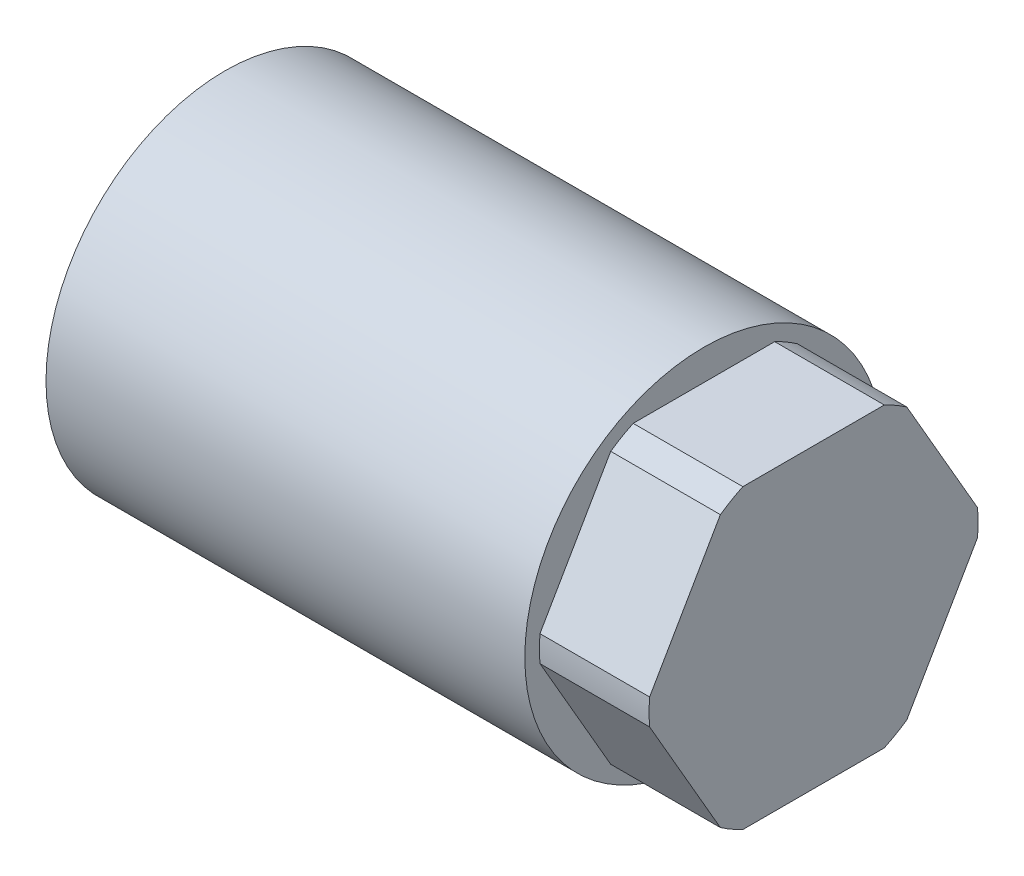
ISO-10303-21;
HEADER;
FILE_DESCRIPTION(('STEP AP214'),'2;1');
FILE_NAME('part.step','',(''),(''),'','','');
FILE_SCHEMA(('AUTOMOTIVE_DESIGN { 1 0 10303 214 1 1 1 1 }'));
ENDSEC;
DATA;
#1=APPLICATION_CONTEXT('core data for automotive mechanical design processes');
#2=APPLICATION_PROTOCOL_DEFINITION('international standard','automotive_design',2000,#1);
#3=PRODUCT_CONTEXT('',#1,'mechanical');
#4=PRODUCT('Part','Part','',(#3));
#5=PRODUCT_RELATED_PRODUCT_CATEGORY('part','',(#4));
#6=PRODUCT_DEFINITION_FORMATION('','',#4);
#7=PRODUCT_DEFINITION_CONTEXT('part definition',#1,'design');
#8=PRODUCT_DEFINITION('design','',#6,#7);
#9=PRODUCT_DEFINITION_SHAPE('','',#8);
#10=(LENGTH_UNIT() NAMED_UNIT(*) SI_UNIT(.MILLI.,.METRE.));
#11=(NAMED_UNIT(*) PLANE_ANGLE_UNIT() SI_UNIT($,.RADIAN.));
#12=(NAMED_UNIT(*) SI_UNIT($,.STERADIAN.) SOLID_ANGLE_UNIT());
#13=UNCERTAINTY_MEASURE_WITH_UNIT(LENGTH_MEASURE(1.E-05),#10,'distance_accuracy_value','');
#14=(GEOMETRIC_REPRESENTATION_CONTEXT(3) GLOBAL_UNCERTAINTY_ASSIGNED_CONTEXT((#13)) GLOBAL_UNIT_ASSIGNED_CONTEXT((#10,
#11,#12)) REPRESENTATION_CONTEXT('',''));
#15=CARTESIAN_POINT('',(0.,0.,0.));
#16=DIRECTION('',(0.,0.,1.));
#17=DIRECTION('',(1.,0.,0.));
#18=AXIS2_PLACEMENT_3D('',#15,#16,#17);
#19=CARTESIAN_POINT('',(0.,6.35,0.));
#20=DIRECTION('',(-1.,0.,0.));
#21=DIRECTION('',(0.,-1.,0.));
#22=AXIS2_PLACEMENT_3D('',#19,#20,#21);
#23=PLANE('',#22);
#24=DIRECTION('',(0.,0.866025403784438,0.5));
#25=VECTOR('',#24,1.);
#26=CARTESIAN_POINT('',(0.,0.,-11.9150661804009));
#27=LINE('',#26,#25);
#28=CARTESIAN_POINT('',(0.,0.901884679620536,-11.394362817844));
#29=VERTEX_POINT('',#28);
#30=CARTESIAN_POINT('',(0.,9.41686532037948,-6.47823645275736));
#31=VERTEX_POINT('',#30);
#32=EDGE_CURVE('E195',#29,#31,#27,.T.);
#33=ORIENTED_EDGE('',*,*,#32,.T.);
#34=CARTESIAN_POINT('',(0.,0.,0.));
#35=DIRECTION('',(-1.,0.,0.));
#36=DIRECTION('',(0.,-1.,0.));
#37=AXIS2_PLACEMENT_3D('',#34,#35,#36);
#38=CIRCLE('',#37,11.43);
#39=CARTESIAN_POINT('',(0.,10.31875,-4.91612636508663));
#40=VERTEX_POINT('',#39);
#41=EDGE_CURVE('E234',#40,#31,#38,.T.);
#42=ORIENTED_EDGE('',*,*,#41,.F.);
#43=DIRECTION('',(0.,0.,1.));
#44=VECTOR('',#43,1.);
#45=CARTESIAN_POINT('',(0.,10.31875,-5.95753309020045));
#46=LINE('',#45,#44);
#47=CARTESIAN_POINT('',(0.,10.31875,4.91612636508663));
#48=VERTEX_POINT('',#47);
#49=EDGE_CURVE('E135',#40,#48,#46,.T.);
#50=ORIENTED_EDGE('',*,*,#49,.T.);
#51=CARTESIAN_POINT('',(0.,9.41686532037948,6.47823645275736));
#52=VERTEX_POINT('',#51);
#53=EDGE_CURVE('E232',#52,#48,#38,.T.);
#54=ORIENTED_EDGE('',*,*,#53,.F.);
#55=DIRECTION('',(0.,-0.866025403784439,0.5));
#56=VECTOR('',#55,1.);
#57=CARTESIAN_POINT('',(0.,10.31875,5.95753309020045));
#58=LINE('',#57,#56);
#59=CARTESIAN_POINT('',(0.,0.901884679620534,11.394362817844));
#60=VERTEX_POINT('',#59);
#61=EDGE_CURVE('E201',#52,#60,#58,.T.);
#62=ORIENTED_EDGE('',*,*,#61,.T.);
#63=CARTESIAN_POINT('',(0.,-0.901884679620526,11.394362817844));
#64=VERTEX_POINT('',#63);
#65=EDGE_CURVE('E48',#64,#60,#38,.T.);
#66=ORIENTED_EDGE('',*,*,#65,.F.);
#67=DIRECTION('',(0.,-0.866025403784438,-0.5));
#68=VECTOR('',#67,1.);
#69=CARTESIAN_POINT('',(0.,0.,11.9150661804009));
#70=LINE('',#69,#68);
#71=CARTESIAN_POINT('',(0.,-9.41686532037948,6.47823645275736));
#72=VERTEX_POINT('',#71);
#73=EDGE_CURVE('E204',#64,#72,#70,.T.);
#74=ORIENTED_EDGE('',*,*,#73,.T.);
#75=CARTESIAN_POINT('',(0.,-10.31875,4.91612636508663));
#76=VERTEX_POINT('',#75);
#77=EDGE_CURVE('E12',#76,#72,#38,.T.);
#78=ORIENTED_EDGE('',*,*,#77,.F.);
#79=DIRECTION('',(0.,0.,-1.));
#80=VECTOR('',#79,1.);
#81=CARTESIAN_POINT('',(0.,-10.31875,5.95753309020045));
#82=LINE('',#81,#80);
#83=CARTESIAN_POINT('',(0.,-10.31875,-4.91612636508663));
#84=VERTEX_POINT('',#83);
#85=EDGE_CURVE('E207',#76,#84,#82,.T.);
#86=ORIENTED_EDGE('',*,*,#85,.T.);
#87=CARTESIAN_POINT('',(0.,-9.41686532037947,-6.47823645275737));
#88=VERTEX_POINT('',#87);
#89=EDGE_CURVE('E49',#88,#84,#38,.T.);
#90=ORIENTED_EDGE('',*,*,#89,.F.);
#91=DIRECTION('',(0.,0.866025403784439,-0.5));
#92=VECTOR('',#91,1.);
#93=CARTESIAN_POINT('',(0.,-10.31875,-5.95753309020046));
#94=LINE('',#93,#92);
#95=CARTESIAN_POINT('',(0.,-0.901884679620541,-11.394362817844));
#96=VERTEX_POINT('',#95);
#97=EDGE_CURVE('E198',#88,#96,#94,.T.);
#98=ORIENTED_EDGE('',*,*,#97,.T.);
#99=EDGE_CURVE('E144',#29,#96,#38,.T.);
#100=ORIENTED_EDGE('',*,*,#99,.F.);
#101=EDGE_LOOP('',(#33,#42,#50,#54,#62,#66,#74,#78,#86,#90,#98,#100));
#102=FACE_BOUND('',#101,.T.);
#103=ADVANCED_FACE('F41',(#102),#23,.F.);
#104=CARTESIAN_POINT('',(-40.894,0.,0.));
#105=DIRECTION('',(-1.,0.,0.));
#106=DIRECTION('',(0.,-1.,0.));
#107=AXIS2_PLACEMENT_3D('',#104,#105,#106);
#108=CYLINDRICAL_SURFACE('',#107,11.43);
#109=DIRECTION('',(-1.,0.,0.));
#110=VECTOR('',#109,1.);
#111=CARTESIAN_POINT('',(-40.894,0.901884679620536,-11.394362817844));
#112=LINE('',#111,#110);
#113=CARTESIAN_POINT('',(-7.62,0.901884679620538,-11.394362817844));
#114=VERTEX_POINT('',#113);
#115=EDGE_CURVE('E162',#29,#114,#112,.T.);
#116=ORIENTED_EDGE('',*,*,#115,.F.);
#117=ORIENTED_EDGE('',*,*,#99,.T.);
#118=DIRECTION('',(-1.,0.,0.));
#119=VECTOR('',#118,1.);
#120=CARTESIAN_POINT('',(-40.894,-0.901884679620542,-11.394362817844));
#121=LINE('',#120,#119);
#122=CARTESIAN_POINT('',(-7.62,-0.901884679620541,-11.394362817844));
#123=VERTEX_POINT('',#122);
#124=EDGE_CURVE('E130',#123,#96,#121,.F.);
#125=ORIENTED_EDGE('',*,*,#124,.F.);
#126=CARTESIAN_POINT('',(-7.62,0.,0.));
#127=DIRECTION('',(-1.,0.,0.));
#128=DIRECTION('',(0.,-1.,0.));
#129=AXIS2_PLACEMENT_3D('',#126,#127,#128);
#130=CIRCLE('',#129,11.43);
#131=EDGE_CURVE('E142',#114,#123,#130,.T.);
#132=ORIENTED_EDGE('',*,*,#131,.F.);
#133=EDGE_LOOP('',(#116,#117,#125,#132));
#134=FACE_BOUND('',#133,.T.);
#135=ADVANCED_FACE('F141',(#134),#108,.T.);
#136=DIRECTION('',(-1.,0.,0.));
#137=VECTOR('',#136,1.);
#138=CARTESIAN_POINT('',(-40.894,9.41686532037948,-6.47823645275736));
#139=LINE('',#138,#137);
#140=CARTESIAN_POINT('',(-7.62,9.41686532037948,-6.47823645275736));
#141=VERTEX_POINT('',#140);
#142=EDGE_CURVE('E164',#141,#31,#139,.F.);
#143=ORIENTED_EDGE('',*,*,#142,.F.);
#144=CARTESIAN_POINT('',(-7.62,10.31875,-4.91612636508663));
#145=VERTEX_POINT('',#144);
#146=EDGE_CURVE('E149',#145,#141,#130,.T.);
#147=ORIENTED_EDGE('',*,*,#146,.F.);
#148=DIRECTION('',(-1.,0.,0.));
#149=VECTOR('',#148,1.);
#150=CARTESIAN_POINT('',(-40.894,10.31875,-4.91612636508663));
#151=LINE('',#150,#149);
#152=EDGE_CURVE('E181',#40,#145,#151,.T.);
#153=ORIENTED_EDGE('',*,*,#152,.F.);
#154=ORIENTED_EDGE('',*,*,#41,.T.);
#155=EDGE_LOOP('',(#143,#147,#153,#154));
#156=FACE_BOUND('',#155,.T.);
#157=ADVANCED_FACE('F243',(#156),#108,.T.);
#158=DIRECTION('',(-1.,0.,0.));
#159=VECTOR('',#158,1.);
#160=CARTESIAN_POINT('',(-40.894,-9.41686532037947,-6.47823645275737));
#161=LINE('',#160,#159);
#162=CARTESIAN_POINT('',(-7.62,-9.41686532037947,-6.47823645275738));
#163=VERTEX_POINT('',#162);
#164=EDGE_CURVE('E133',#88,#163,#161,.T.);
#165=ORIENTED_EDGE('',*,*,#164,.F.);
#166=ORIENTED_EDGE('',*,*,#89,.T.);
#167=DIRECTION('',(-1.,0.,0.));
#168=VECTOR('',#167,1.);
#169=CARTESIAN_POINT('',(-40.894,-10.31875,-4.91612636508663));
#170=LINE('',#169,#168);
#171=CARTESIAN_POINT('',(-7.62,-10.31875,-4.91612636508663));
#172=VERTEX_POINT('',#171);
#173=EDGE_CURVE('E169',#172,#84,#170,.F.);
#174=ORIENTED_EDGE('',*,*,#173,.F.);
#175=EDGE_CURVE('E150',#163,#172,#130,.T.);
#176=ORIENTED_EDGE('',*,*,#175,.F.);
#177=EDGE_LOOP('',(#165,#166,#174,#176));
#178=FACE_BOUND('',#177,.T.);
#179=ADVANCED_FACE('F214',(#178),#108,.T.);
#180=DIRECTION('',(-1.,0.,0.));
#181=VECTOR('',#180,1.);
#182=CARTESIAN_POINT('',(-40.894,-10.31875,4.91612636508663));
#183=LINE('',#182,#181);
#184=CARTESIAN_POINT('',(-7.62,-10.31875,4.91612636508663));
#185=VERTEX_POINT('',#184);
#186=EDGE_CURVE('E145',#76,#185,#183,.T.);
#187=ORIENTED_EDGE('',*,*,#186,.F.);
#188=ORIENTED_EDGE('',*,*,#77,.T.);
#189=DIRECTION('',(-1.,0.,0.));
#190=VECTOR('',#189,1.);
#191=CARTESIAN_POINT('',(-40.894,-9.41686532037948,6.47823645275736));
#192=LINE('',#191,#190);
#193=CARTESIAN_POINT('',(-7.62,-9.41686532037948,6.47823645275736));
#194=VERTEX_POINT('',#193);
#195=EDGE_CURVE('E174',#194,#72,#192,.F.);
#196=ORIENTED_EDGE('',*,*,#195,.F.);
#197=EDGE_CURVE('E153',#185,#194,#130,.T.);
#198=ORIENTED_EDGE('',*,*,#197,.F.);
#199=EDGE_LOOP('',(#187,#188,#196,#198));
#200=FACE_BOUND('',#199,.T.);
#201=ADVANCED_FACE('F223',(#200),#108,.T.);
#202=DIRECTION('',(-1.,0.,0.));
#203=VECTOR('',#202,1.);
#204=CARTESIAN_POINT('',(-40.894,-0.901884679620529,11.394362817844));
#205=LINE('',#204,#203);
#206=CARTESIAN_POINT('',(-7.62,-0.901884679620534,11.394362817844));
#207=VERTEX_POINT('',#206);
#208=EDGE_CURVE('E171',#64,#207,#205,.T.);
#209=ORIENTED_EDGE('',*,*,#208,.F.);
#210=ORIENTED_EDGE('',*,*,#65,.T.);
#211=DIRECTION('',(-1.,0.,0.));
#212=VECTOR('',#211,1.);
#213=CARTESIAN_POINT('',(-40.894,0.901884679620534,11.394362817844));
#214=LINE('',#213,#212);
#215=CARTESIAN_POINT('',(-7.62,0.901884679620536,11.394362817844));
#216=VERTEX_POINT('',#215);
#217=EDGE_CURVE('E179',#216,#60,#214,.F.);
#218=ORIENTED_EDGE('',*,*,#217,.F.);
#219=EDGE_CURVE('E156',#207,#216,#130,.T.);
#220=ORIENTED_EDGE('',*,*,#219,.F.);
#221=EDGE_LOOP('',(#209,#210,#218,#220));
#222=FACE_BOUND('',#221,.T.);
#223=ADVANCED_FACE('F269',(#222),#108,.T.);
#224=DIRECTION('',(-1.,0.,0.));
#225=VECTOR('',#224,1.);
#226=CARTESIAN_POINT('',(-40.894,9.41686532037948,6.47823645275736));
#227=LINE('',#226,#225);
#228=CARTESIAN_POINT('',(-7.62,9.41686532037947,6.47823645275737));
#229=VERTEX_POINT('',#228);
#230=EDGE_CURVE('E176',#52,#229,#227,.T.);
#231=ORIENTED_EDGE('',*,*,#230,.F.);
#232=ORIENTED_EDGE('',*,*,#53,.T.);
#233=DIRECTION('',(-1.,0.,0.));
#234=VECTOR('',#233,1.);
#235=CARTESIAN_POINT('',(-40.894,10.31875,4.91612636508663));
#236=LINE('',#235,#234);
#237=CARTESIAN_POINT('',(-7.62,10.31875,4.91612636508663));
#238=VERTEX_POINT('',#237);
#239=EDGE_CURVE('E184',#238,#48,#236,.F.);
#240=ORIENTED_EDGE('',*,*,#239,.F.);
#241=EDGE_CURVE('E151',#229,#238,#130,.T.);
#242=ORIENTED_EDGE('',*,*,#241,.F.);
#243=EDGE_LOOP('',(#231,#232,#240,#242));
#244=FACE_BOUND('',#243,.T.);
#245=ADVANCED_FACE('F263',(#244),#108,.T.);
#246=CARTESIAN_POINT('',(-7.62,11.43,0.));
#247=DIRECTION('',(-1.,0.,0.));
#248=DIRECTION('',(0.,-1.,0.));
#249=AXIS2_PLACEMENT_3D('',#246,#247,#248);
#250=PLANE('',#249);
#251=ORIENTED_EDGE('',*,*,#146,.T.);
#252=DIRECTION('',(0.,0.866025403784439,0.5));
#253=VECTOR('',#252,1.);
#254=CARTESIAN_POINT('',(-7.62,0.,-11.9150661804009));
#255=LINE('',#254,#253);
#256=EDGE_CURVE('E62',#114,#141,#255,.T.);
#257=ORIENTED_EDGE('',*,*,#256,.F.);
#258=ORIENTED_EDGE('',*,*,#131,.T.);
#259=DIRECTION('',(0.,0.866025403784439,-0.5));
#260=VECTOR('',#259,1.);
#261=CARTESIAN_POINT('',(-7.62,-10.31875,-5.95753309020046));
#262=LINE('',#261,#260);
#263=EDGE_CURVE('E56',#163,#123,#262,.T.);
#264=ORIENTED_EDGE('',*,*,#263,.F.);
#265=ORIENTED_EDGE('',*,*,#175,.T.);
#266=DIRECTION('',(0.,0.,-1.));
#267=VECTOR('',#266,1.);
#268=CARTESIAN_POINT('',(-7.62,-10.31875,5.95753309020045));
#269=LINE('',#268,#267);
#270=EDGE_CURVE('E186',#185,#172,#269,.T.);
#271=ORIENTED_EDGE('',*,*,#270,.F.);
#272=ORIENTED_EDGE('',*,*,#197,.T.);
#273=DIRECTION('',(0.,-0.866025403784439,-0.5));
#274=VECTOR('',#273,1.);
#275=CARTESIAN_POINT('',(-7.62,0.,11.9150661804009));
#276=LINE('',#275,#274);
#277=EDGE_CURVE('E191',#207,#194,#276,.T.);
#278=ORIENTED_EDGE('',*,*,#277,.F.);
#279=ORIENTED_EDGE('',*,*,#219,.T.);
#280=DIRECTION('',(0.,-0.866025403784439,0.5));
#281=VECTOR('',#280,1.);
#282=CARTESIAN_POINT('',(-7.62,10.31875,5.95753309020045));
#283=LINE('',#282,#281);
#284=EDGE_CURVE('E189',#229,#216,#283,.T.);
#285=ORIENTED_EDGE('',*,*,#284,.F.);
#286=ORIENTED_EDGE('',*,*,#241,.T.);
#287=DIRECTION('',(0.,0.,1.));
#288=VECTOR('',#287,1.);
#289=CARTESIAN_POINT('',(-7.62,10.31875,-5.95753309020045));
#290=LINE('',#289,#288);
#291=EDGE_CURVE('E187',#145,#238,#290,.T.);
#292=ORIENTED_EDGE('',*,*,#291,.F.);
#293=EDGE_LOOP('',(#251,#257,#258,#264,#265,#271,#272,#278,#279,#285,#286,#292));
#294=FACE_BOUND('',#293,.T.);
#295=CARTESIAN_POINT('',(-7.62,0.,0.));
#296=DIRECTION('',(-1.,0.,0.));
#297=DIRECTION('',(0.,-1.,0.));
#298=AXIS2_PLACEMENT_3D('',#295,#296,#297);
#299=CIRCLE('',#298,12.446);
#300=CARTESIAN_POINT('',(-7.62,-12.446,0.));
#301=VERTEX_POINT('',#300);
#302=EDGE_CURVE('E152',#301,#301,#299,.T.);
#303=ORIENTED_EDGE('',*,*,#302,.F.);
#304=EDGE_LOOP('',(#303));
#305=FACE_BOUND('',#304,.T.);
#306=ADVANCED_FACE('F147',(#294,#305),#250,.F.);
#307=CARTESIAN_POINT('',(-40.894,0.,0.));
#308=DIRECTION('',(-1.,0.,0.));
#309=DIRECTION('',(0.,-1.,0.));
#310=AXIS2_PLACEMENT_3D('',#307,#308,#309);
#311=CYLINDRICAL_SURFACE('',#310,12.446);
#312=CARTESIAN_POINT('',(-40.894,0.,0.));
#313=DIRECTION('',(-1.,0.,0.));
#314=DIRECTION('',(0.,-1.,0.));
#315=AXIS2_PLACEMENT_3D('',#312,#313,#314);
#316=CIRCLE('',#315,12.446);
#317=CARTESIAN_POINT('',(-40.894,-12.446,0.));
#318=VERTEX_POINT('',#317);
#319=EDGE_CURVE('E159',#318,#318,#316,.T.);
#320=ORIENTED_EDGE('',*,*,#319,.F.);
#321=EDGE_LOOP('',(#320));
#322=FACE_BOUND('',#321,.T.);
#323=ORIENTED_EDGE('',*,*,#302,.T.);
#324=EDGE_LOOP('',(#323));
#325=FACE_BOUND('',#324,.T.);
#326=ADVANCED_FACE('F274',(#322,#325),#311,.T.);
#327=CARTESIAN_POINT('',(-40.894,12.446,0.));
#328=DIRECTION('',(1.,0.,0.));
#329=DIRECTION('',(0.,1.,0.));
#330=AXIS2_PLACEMENT_3D('',#327,#328,#329);
#331=PLANE('',#330);
#332=ORIENTED_EDGE('',*,*,#319,.T.);
#333=EDGE_LOOP('',(#332));
#334=FACE_BOUND('',#333,.T.);
#335=ADVANCED_FACE('F288',(#334),#331,.F.);
#336=CARTESIAN_POINT('',(-45.213771840578,-10.31875,5.95753309020045));
#337=DIRECTION('',(0.,-1.,0.));
#338=DIRECTION('',(1.,0.,0.));
#339=AXIS2_PLACEMENT_3D('',#336,#337,#338);
#340=PLANE('',#339);
#341=ORIENTED_EDGE('',*,*,#186,.T.);
#342=ORIENTED_EDGE('',*,*,#270,.T.);
#343=ORIENTED_EDGE('',*,*,#173,.T.);
#344=ORIENTED_EDGE('',*,*,#85,.F.);
#345=EDGE_LOOP('',(#341,#342,#343,#344));
#346=FACE_BOUND('',#345,.T.);
#347=ADVANCED_FACE('F219',(#346),#340,.T.);
#348=CARTESIAN_POINT('',(-45.213771840578,-10.31875,-5.95753309020046));
#349=DIRECTION('',(0.,-0.5,-0.866025403784438));
#350=DIRECTION('',(0.,0.866025403784439,-0.5));
#351=AXIS2_PLACEMENT_3D('',#348,#349,#350);
#352=PLANE('',#351);
#353=ORIENTED_EDGE('',*,*,#164,.T.);
#354=ORIENTED_EDGE('',*,*,#263,.T.);
#355=ORIENTED_EDGE('',*,*,#124,.T.);
#356=ORIENTED_EDGE('',*,*,#97,.F.);
#357=EDGE_LOOP('',(#353,#354,#355,#356));
#358=FACE_BOUND('',#357,.T.);
#359=ADVANCED_FACE('F129',(#358),#352,.T.);
#360=CARTESIAN_POINT('',(-45.213771840578,0.,-11.9150661804009));
#361=DIRECTION('',(0.,0.5,-0.866025403784438));
#362=DIRECTION('',(0.,0.866025403784439,0.5));
#363=AXIS2_PLACEMENT_3D('',#360,#361,#362);
#364=PLANE('',#363);
#365=ORIENTED_EDGE('',*,*,#115,.T.);
#366=ORIENTED_EDGE('',*,*,#256,.T.);
#367=ORIENTED_EDGE('',*,*,#142,.T.);
#368=ORIENTED_EDGE('',*,*,#32,.F.);
#369=EDGE_LOOP('',(#365,#366,#367,#368));
#370=FACE_BOUND('',#369,.T.);
#371=ADVANCED_FACE('F246',(#370),#364,.T.);
#372=CARTESIAN_POINT('',(-45.213771840578,10.31875,-5.95753309020045));
#373=DIRECTION('',(0.,1.,0.));
#374=DIRECTION('',(-1.,0.,0.));
#375=AXIS2_PLACEMENT_3D('',#372,#373,#374);
#376=PLANE('',#375);
#377=ORIENTED_EDGE('',*,*,#152,.T.);
#378=ORIENTED_EDGE('',*,*,#291,.T.);
#379=ORIENTED_EDGE('',*,*,#239,.T.);
#380=ORIENTED_EDGE('',*,*,#49,.F.);
#381=EDGE_LOOP('',(#377,#378,#379,#380));
#382=FACE_BOUND('',#381,.T.);
#383=ADVANCED_FACE('F248',(#382),#376,.T.);
#384=CARTESIAN_POINT('',(-45.213771840578,10.31875,5.95753309020045));
#385=DIRECTION('',(0.,0.5,0.866025403784438));
#386=DIRECTION('',(0.,-0.866025403784439,0.5));
#387=AXIS2_PLACEMENT_3D('',#384,#385,#386);
#388=PLANE('',#387);
#389=ORIENTED_EDGE('',*,*,#230,.T.);
#390=ORIENTED_EDGE('',*,*,#284,.T.);
#391=ORIENTED_EDGE('',*,*,#217,.T.);
#392=ORIENTED_EDGE('',*,*,#61,.F.);
#393=EDGE_LOOP('',(#389,#390,#391,#392));
#394=FACE_BOUND('',#393,.T.);
#395=ADVANCED_FACE('F254',(#394),#388,.T.);
#396=CARTESIAN_POINT('',(-45.213771840578,0.,11.9150661804009));
#397=DIRECTION('',(0.,-0.5,0.866025403784438));
#398=DIRECTION('',(0.,-0.866025403784439,-0.5));
#399=AXIS2_PLACEMENT_3D('',#396,#397,#398);
#400=PLANE('',#399);
#401=ORIENTED_EDGE('',*,*,#208,.T.);
#402=ORIENTED_EDGE('',*,*,#277,.T.);
#403=ORIENTED_EDGE('',*,*,#195,.T.);
#404=ORIENTED_EDGE('',*,*,#73,.F.);
#405=EDGE_LOOP('',(#401,#402,#403,#404));
#406=FACE_BOUND('',#405,.T.);
#407=ADVANCED_FACE('F225',(#406),#400,.T.);
#408=CLOSED_SHELL('',(#103,#135,#157,#179,#201,#223,#245,#306,#326,#335,#347,#359,#371,#383,
#395,#407));
#409=MANIFOLD_SOLID_BREP('B2',#408);
#410=ADVANCED_BREP_SHAPE_REPRESENTATION('',(#18,#409),#14);
#411=SHAPE_DEFINITION_REPRESENTATION(#9,#410);
ENDSEC;
END-ISO-10303-21;
